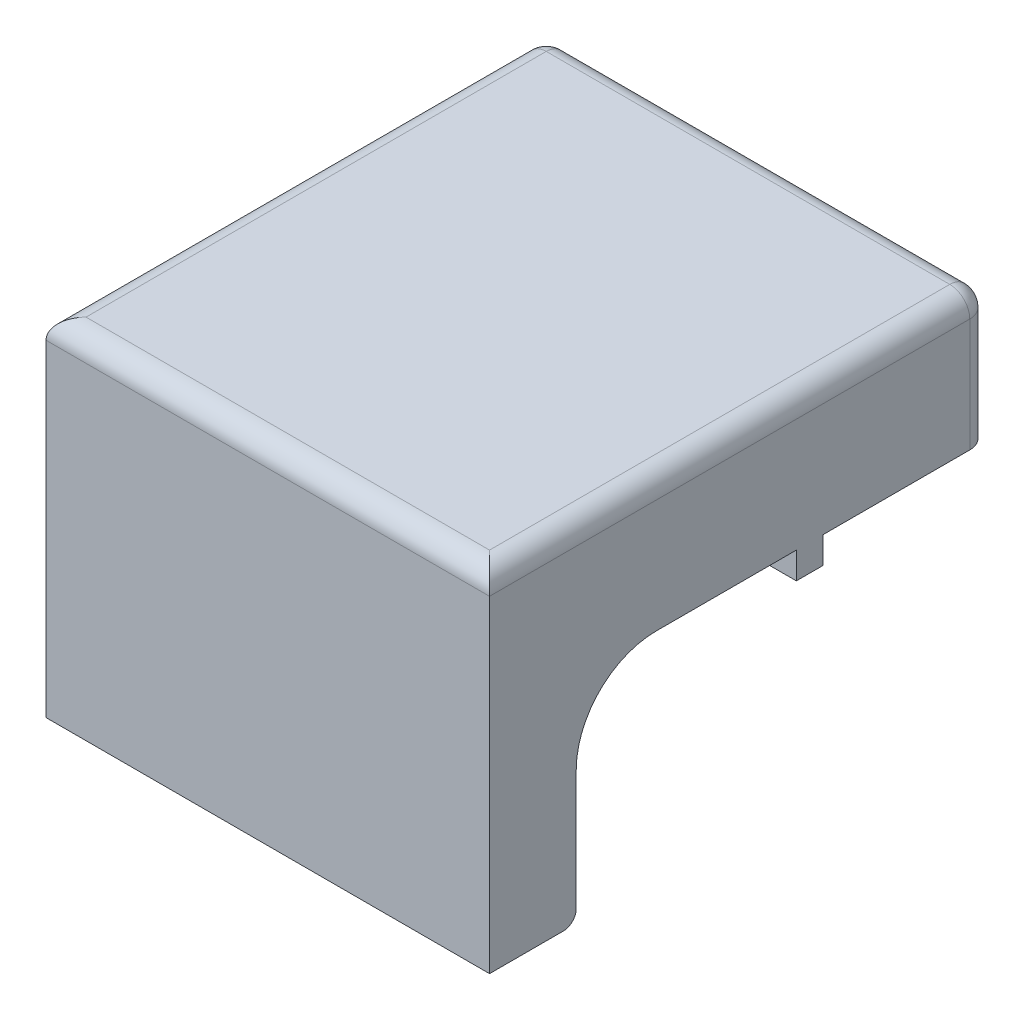
ISO-10303-21;
HEADER;
FILE_DESCRIPTION(('STEP AP214'),'2;1');
FILE_NAME('part.step','',(''),(''),'','','');
FILE_SCHEMA(('AUTOMOTIVE_DESIGN { 1 0 10303 214 1 1 1 1 }'));
ENDSEC;
DATA;
#1=APPLICATION_CONTEXT('core data for automotive mechanical design processes');
#2=APPLICATION_PROTOCOL_DEFINITION('international standard','automotive_design',2000,#1);
#3=PRODUCT_CONTEXT('',#1,'mechanical');
#4=PRODUCT('Part','Part','',(#3));
#5=PRODUCT_RELATED_PRODUCT_CATEGORY('part','',(#4));
#6=PRODUCT_DEFINITION_FORMATION('','',#4);
#7=PRODUCT_DEFINITION_CONTEXT('part definition',#1,'design');
#8=PRODUCT_DEFINITION('design','',#6,#7);
#9=PRODUCT_DEFINITION_SHAPE('','',#8);
#10=(LENGTH_UNIT() NAMED_UNIT(*) SI_UNIT(.MILLI.,.METRE.));
#11=(NAMED_UNIT(*) PLANE_ANGLE_UNIT() SI_UNIT($,.RADIAN.));
#12=(NAMED_UNIT(*) SI_UNIT($,.STERADIAN.) SOLID_ANGLE_UNIT());
#13=UNCERTAINTY_MEASURE_WITH_UNIT(LENGTH_MEASURE(1.E-05),#10,'distance_accuracy_value','');
#14=(GEOMETRIC_REPRESENTATION_CONTEXT(3) GLOBAL_UNCERTAINTY_ASSIGNED_CONTEXT((#13)) GLOBAL_UNIT_ASSIGNED_CONTEXT((#10,
#11,#12)) REPRESENTATION_CONTEXT('',''));
#15=CARTESIAN_POINT('',(0.,0.,0.));
#16=DIRECTION('',(0.,0.,1.));
#17=DIRECTION('',(1.,0.,0.));
#18=AXIS2_PLACEMENT_3D('',#15,#16,#17);
#19=CARTESIAN_POINT('',(0.,-10.,0.));
#20=DIRECTION('',(0.,1.,0.));
#21=DIRECTION('',(0.,0.,1.));
#22=AXIS2_PLACEMENT_3D('',#19,#20,#21);
#23=PLANE('',#22);
#24=DIRECTION('',(-1.,0.,0.));
#25=VECTOR('',#24,1.);
#26=CARTESIAN_POINT('',(23.,-10.,29.));
#27=LINE('',#26,#25);
#28=CARTESIAN_POINT('',(23.,-10.,29.));
#29=VERTEX_POINT('',#28);
#30=CARTESIAN_POINT('',(15.5,-10.,29.));
#31=VERTEX_POINT('',#30);
#32=EDGE_CURVE('E256',#29,#31,#27,.T.);
#33=ORIENTED_EDGE('',*,*,#32,.F.);
#34=DIRECTION('',(0.,0.,1.));
#35=VECTOR('',#34,1.);
#36=CARTESIAN_POINT('',(23.,-10.,0.));
#37=LINE('',#36,#35);
#38=CARTESIAN_POINT('',(23.,-10.,50.));
#39=VERTEX_POINT('',#38);
#40=EDGE_CURVE('E340',#29,#39,#37,.T.);
#41=ORIENTED_EDGE('',*,*,#40,.T.);
#42=DIRECTION('',(-1.,0.,0.));
#43=VECTOR('',#42,1.);
#44=CARTESIAN_POINT('',(0.,-10.,50.));
#45=LINE('',#44,#43);
#46=CARTESIAN_POINT('',(15.5,-10.,50.));
#47=VERTEX_POINT('',#46);
#48=EDGE_CURVE('E422',#39,#47,#45,.T.);
#49=ORIENTED_EDGE('',*,*,#48,.T.);
#50=DIRECTION('',(0.,0.,-1.));
#51=VECTOR('',#50,1.);
#52=CARTESIAN_POINT('',(15.5,-10.,7.5));
#53=LINE('',#52,#51);
#54=EDGE_CURVE('E244',#47,#31,#53,.T.);
#55=ORIENTED_EDGE('',*,*,#54,.T.);
#56=EDGE_LOOP('',(#33,#41,#49,#55));
#57=FACE_BOUND('',#56,.T.);
#58=ADVANCED_FACE('F49',(#57),#23,.F.);
#59=DIRECTION('',(1.,0.,0.));
#60=VECTOR('',#59,1.);
#61=CARTESIAN_POINT('',(-43.5,-10.,0.));
#62=LINE('',#61,#60);
#63=CARTESIAN_POINT('',(0.0437285255018155,-10.,0.));
#64=VERTEX_POINT('',#63);
#65=CARTESIAN_POINT('',(20.,-10.,0.));
#66=VERTEX_POINT('',#65);
#67=EDGE_CURVE('E335',#64,#66,#62,.T.);
#68=ORIENTED_EDGE('',*,*,#67,.T.);
#69=CARTESIAN_POINT('',(20.,-10.,3.));
#70=DIRECTION('',(0.,1.,0.));
#71=DIRECTION('',(0.,0.,1.));
#72=AXIS2_PLACEMENT_3D('',#69,#70,#71);
#73=CIRCLE('',#72,3.);
#74=CARTESIAN_POINT('',(23.,-10.,3.));
#75=VERTEX_POINT('',#74);
#76=EDGE_CURVE('E460',#66,#75,#73,.F.);
#77=ORIENTED_EDGE('',*,*,#76,.T.);
#78=CARTESIAN_POINT('',(23.,-10.,25.));
#79=VERTEX_POINT('',#78);
#80=EDGE_CURVE('E245',#75,#79,#37,.T.);
#81=ORIENTED_EDGE('',*,*,#80,.T.);
#82=DIRECTION('',(1.,0.,0.));
#83=VECTOR('',#82,1.);
#84=CARTESIAN_POINT('',(23.,-10.,25.));
#85=LINE('',#84,#83);
#86=CARTESIAN_POINT('',(15.5,-10.,25.));
#87=VERTEX_POINT('',#86);
#88=EDGE_CURVE('E248',#87,#79,#85,.T.);
#89=ORIENTED_EDGE('',*,*,#88,.F.);
#90=CARTESIAN_POINT('',(15.5,-10.,7.5));
#91=VERTEX_POINT('',#90);
#92=EDGE_CURVE('E231',#87,#91,#53,.T.);
#93=ORIENTED_EDGE('',*,*,#92,.T.);
#94=DIRECTION('',(-1.,0.,0.));
#95=VECTOR('',#94,1.);
#96=CARTESIAN_POINT('',(-36.,-10.,7.5));
#97=LINE('',#96,#95);
#98=CARTESIAN_POINT('',(0.0437285255018155,-10.,7.5));
#99=VERTEX_POINT('',#98);
#100=EDGE_CURVE('E345',#91,#99,#97,.T.);
#101=ORIENTED_EDGE('',*,*,#100,.T.);
#102=DIRECTION('',(0.,0.,-1.));
#103=VECTOR('',#102,1.);
#104=CARTESIAN_POINT('',(0.0437285255018155,-10.,10.));
#105=LINE('',#104,#103);
#106=EDGE_CURVE('E407',#99,#64,#105,.T.);
#107=ORIENTED_EDGE('',*,*,#106,.T.);
#108=EDGE_LOOP('',(#68,#77,#81,#89,#93,#101,#107));
#109=FACE_BOUND('',#108,.T.);
#110=ADVANCED_FACE('F250',(#109),#23,.F.);
#111=DIRECTION('',(0.,0.,-1.));
#112=VECTOR('',#111,1.);
#113=CARTESIAN_POINT('',(-43.5,-10.,0.));
#114=LINE('',#113,#112);
#115=CARTESIAN_POINT('',(-43.5,-10.,25.));
#116=VERTEX_POINT('',#115);
#117=CARTESIAN_POINT('',(-43.5,-10.,3.00000000000001));
#118=VERTEX_POINT('',#117);
#119=EDGE_CURVE('E336',#116,#118,#114,.T.);
#120=ORIENTED_EDGE('',*,*,#119,.T.);
#121=CARTESIAN_POINT('',(-40.5,-10.,3.));
#122=DIRECTION('',(0.,1.,0.));
#123=DIRECTION('',(0.,0.,1.));
#124=AXIS2_PLACEMENT_3D('',#121,#122,#123);
#125=CIRCLE('',#124,3.);
#126=CARTESIAN_POINT('',(-40.5,-10.,0.));
#127=VERTEX_POINT('',#126);
#128=EDGE_CURVE('E469',#118,#127,#125,.F.);
#129=ORIENTED_EDGE('',*,*,#128,.T.);
#130=CARTESIAN_POINT('',(-32.0437285255018,-10.,0.));
#131=VERTEX_POINT('',#130);
#132=EDGE_CURVE('E337',#127,#131,#62,.T.);
#133=ORIENTED_EDGE('',*,*,#132,.T.);
#134=DIRECTION('',(0.,0.,-1.));
#135=VECTOR('',#134,1.);
#136=CARTESIAN_POINT('',(-32.0437285255018,-10.,10.));
#137=LINE('',#136,#135);
#138=CARTESIAN_POINT('',(-32.0437285255018,-10.,7.5));
#139=VERTEX_POINT('',#138);
#140=EDGE_CURVE('E403',#131,#139,#137,.F.);
#141=ORIENTED_EDGE('',*,*,#140,.T.);
#142=CARTESIAN_POINT('',(-36.,-10.,7.5));
#143=VERTEX_POINT('',#142);
#144=EDGE_CURVE('E344',#139,#143,#97,.T.);
#145=ORIENTED_EDGE('',*,*,#144,.T.);
#146=DIRECTION('',(0.,0.,1.));
#147=VECTOR('',#146,1.);
#148=CARTESIAN_POINT('',(-36.,-10.,62.));
#149=LINE('',#148,#147);
#150=CARTESIAN_POINT('',(-36.,-10.,25.));
#151=VERTEX_POINT('',#150);
#152=EDGE_CURVE('E349',#143,#151,#149,.T.);
#153=ORIENTED_EDGE('',*,*,#152,.T.);
#154=DIRECTION('',(1.,0.,0.));
#155=VECTOR('',#154,1.);
#156=CARTESIAN_POINT('',(-43.5,-10.,25.));
#157=LINE('',#156,#155);
#158=EDGE_CURVE('E276',#116,#151,#157,.T.);
#159=ORIENTED_EDGE('',*,*,#158,.F.);
#160=EDGE_LOOP('',(#120,#129,#133,#141,#145,#153,#159));
#161=FACE_BOUND('',#160,.T.);
#162=ADVANCED_FACE('F593',(#161),#23,.F.);
#163=DIRECTION('',(-1.,0.,0.));
#164=VECTOR('',#163,1.);
#165=CARTESIAN_POINT('',(-43.5,-10.,29.));
#166=LINE('',#165,#164);
#167=CARTESIAN_POINT('',(-36.,-10.,29.));
#168=VERTEX_POINT('',#167);
#169=CARTESIAN_POINT('',(-43.5,-10.,29.));
#170=VERTEX_POINT('',#169);
#171=EDGE_CURVE('E293',#168,#170,#166,.T.);
#172=ORIENTED_EDGE('',*,*,#171,.F.);
#173=CARTESIAN_POINT('',(-36.,-10.,50.));
#174=VERTEX_POINT('',#173);
#175=EDGE_CURVE('E348',#168,#174,#149,.T.);
#176=ORIENTED_EDGE('',*,*,#175,.T.);
#177=DIRECTION('',(-1.,0.,0.));
#178=VECTOR('',#177,1.);
#179=CARTESIAN_POINT('',(0.,-10.,50.));
#180=LINE('',#179,#178);
#181=CARTESIAN_POINT('',(-43.5,-10.,50.));
#182=VERTEX_POINT('',#181);
#183=EDGE_CURVE('E411',#174,#182,#180,.T.);
#184=ORIENTED_EDGE('',*,*,#183,.T.);
#185=EDGE_CURVE('E332',#182,#170,#114,.T.);
#186=ORIENTED_EDGE('',*,*,#185,.T.);
#187=EDGE_LOOP('',(#172,#176,#184,#186));
#188=FACE_BOUND('',#187,.T.);
#189=ADVANCED_FACE('F614',(#188),#23,.F.);
#190=CARTESIAN_POINT('',(0.,0.,0.));
#191=DIRECTION('',(0.,1.,0.));
#192=DIRECTION('',(0.,0.,1.));
#193=AXIS2_PLACEMENT_3D('',#190,#191,#192);
#194=PLANE('',#193);
#195=DIRECTION('',(0.,0.,-1.));
#196=VECTOR('',#195,1.);
#197=CARTESIAN_POINT('',(15.5,0.,7.5));
#198=LINE('',#197,#196);
#199=CARTESIAN_POINT('',(15.5,0.,62.));
#200=VERTEX_POINT('',#199);
#201=CARTESIAN_POINT('',(15.5,0.,7.5));
#202=VERTEX_POINT('',#201);
#203=EDGE_CURVE('E331',#200,#202,#198,.T.);
#204=ORIENTED_EDGE('',*,*,#203,.F.);
#205=DIRECTION('',(-1.,0.,0.));
#206=VECTOR('',#205,1.);
#207=CARTESIAN_POINT('',(0.,0.,62.));
#208=LINE('',#207,#206);
#209=CARTESIAN_POINT('',(-36.,0.,62.));
#210=VERTEX_POINT('',#209);
#211=EDGE_CURVE('E389',#200,#210,#208,.T.);
#212=ORIENTED_EDGE('',*,*,#211,.T.);
#213=DIRECTION('',(0.,0.,1.));
#214=VECTOR('',#213,1.);
#215=CARTESIAN_POINT('',(-36.,0.,62.));
#216=LINE('',#215,#214);
#217=CARTESIAN_POINT('',(-36.,0.,7.5));
#218=VERTEX_POINT('',#217);
#219=EDGE_CURVE('E358',#218,#210,#216,.T.);
#220=ORIENTED_EDGE('',*,*,#219,.F.);
#221=DIRECTION('',(-1.,0.,0.));
#222=VECTOR('',#221,1.);
#223=CARTESIAN_POINT('',(-36.,0.,7.5));
#224=LINE('',#223,#222);
#225=EDGE_CURVE('E355',#202,#218,#224,.T.);
#226=ORIENTED_EDGE('',*,*,#225,.F.);
#227=EDGE_LOOP('',(#204,#212,#220,#226));
#228=FACE_BOUND('',#227,.T.);
#229=ADVANCED_FACE('F631',(#228),#194,.F.);
#230=CARTESIAN_POINT('',(-43.5,10.,62.));
#231=DIRECTION('',(0.,0.,-1.));
#232=DIRECTION('',(-1.,0.,0.));
#233=AXIS2_PLACEMENT_3D('',#230,#231,#232);
#234=PLANE('',#233);
#235=DIRECTION('',(0.,-1.,0.));
#236=VECTOR('',#235,1.);
#237=CARTESIAN_POINT('',(23.,10.,62.));
#238=LINE('',#237,#236);
#239=CARTESIAN_POINT('',(23.,-22.,62.));
#240=VERTEX_POINT('',#239);
#241=CARTESIAN_POINT('',(23.,-40.05,62.));
#242=VERTEX_POINT('',#241);
#243=EDGE_CURVE('E393',#240,#242,#238,.T.);
#244=ORIENTED_EDGE('',*,*,#243,.T.);
#245=DIRECTION('',(1.,0.,0.));
#246=VECTOR('',#245,1.);
#247=CARTESIAN_POINT('',(-43.5,-40.05,62.));
#248=LINE('',#247,#246);
#249=CARTESIAN_POINT('',(-43.5,-40.05,62.));
#250=VERTEX_POINT('',#249);
#251=EDGE_CURVE('E448',#242,#250,#248,.F.);
#252=ORIENTED_EDGE('',*,*,#251,.T.);
#253=DIRECTION('',(0.,-1.,0.));
#254=VECTOR('',#253,1.);
#255=CARTESIAN_POINT('',(-43.5,10.,62.));
#256=LINE('',#255,#254);
#257=CARTESIAN_POINT('',(-43.5,-22.,62.));
#258=VERTEX_POINT('',#257);
#259=EDGE_CURVE('E385',#258,#250,#256,.T.);
#260=ORIENTED_EDGE('',*,*,#259,.F.);
#261=DIRECTION('',(-1.,0.,0.));
#262=VECTOR('',#261,1.);
#263=CARTESIAN_POINT('',(-43.5,-22.,62.));
#264=LINE('',#263,#262);
#265=CARTESIAN_POINT('',(-36.,-22.,62.));
#266=VERTEX_POINT('',#265);
#267=EDGE_CURVE('E418',#258,#266,#264,.F.);
#268=ORIENTED_EDGE('',*,*,#267,.T.);
#269=DIRECTION('',(0.,1.,0.));
#270=VECTOR('',#269,1.);
#271=CARTESIAN_POINT('',(-36.,-10.,62.));
#272=LINE('',#271,#270);
#273=EDGE_CURVE('E352',#266,#210,#272,.T.);
#274=ORIENTED_EDGE('',*,*,#273,.T.);
#275=ORIENTED_EDGE('',*,*,#211,.F.);
#276=DIRECTION('',(0.,1.,0.));
#277=VECTOR('',#276,1.);
#278=CARTESIAN_POINT('',(15.5,-10.,62.));
#279=LINE('',#278,#277);
#280=CARTESIAN_POINT('',(15.5,-22.,62.));
#281=VERTEX_POINT('',#280);
#282=EDGE_CURVE('E370',#281,#200,#279,.T.);
#283=ORIENTED_EDGE('',*,*,#282,.F.);
#284=DIRECTION('',(-1.,0.,0.));
#285=VECTOR('',#284,1.);
#286=CARTESIAN_POINT('',(-43.5,-22.,62.));
#287=LINE('',#286,#285);
#288=EDGE_CURVE('E415',#281,#240,#287,.F.);
#289=ORIENTED_EDGE('',*,*,#288,.T.);
#290=EDGE_LOOP('',(#244,#252,#260,#268,#274,#275,#283,#289));
#291=FACE_BOUND('',#290,.T.);
#292=ADVANCED_FACE('F577',(#291),#234,.T.);
#293=CARTESIAN_POINT('',(0.,10.,0.));
#294=DIRECTION('',(0.,0.,1.));
#295=DIRECTION('',(1.,0.,0.));
#296=AXIS2_PLACEMENT_3D('',#293,#294,#295);
#297=PLANE('',#296);
#298=DIRECTION('',(0.,-1.,0.));
#299=VECTOR('',#298,1.);
#300=CARTESIAN_POINT('',(-40.5,10.,0.));
#301=LINE('',#300,#299);
#302=CARTESIAN_POINT('',(-40.5,7.,0.));
#303=VERTEX_POINT('',#302);
#304=EDGE_CURVE('E454',#127,#303,#301,.F.);
#305=ORIENTED_EDGE('',*,*,#304,.T.);
#306=DIRECTION('',(-1.,0.,0.));
#307=VECTOR('',#306,1.);
#308=CARTESIAN_POINT('',(20.,7.,0.));
#309=LINE('',#308,#307);
#310=CARTESIAN_POINT('',(20.,7.,0.));
#311=VERTEX_POINT('',#310);
#312=EDGE_CURVE('E74',#303,#311,#309,.F.);
#313=ORIENTED_EDGE('',*,*,#312,.T.);
#314=DIRECTION('',(0.,-1.,0.));
#315=VECTOR('',#314,1.);
#316=CARTESIAN_POINT('',(20.,10.,0.));
#317=LINE('',#316,#315);
#318=EDGE_CURVE('E457',#311,#66,#317,.T.);
#319=ORIENTED_EDGE('',*,*,#318,.T.);
#320=ORIENTED_EDGE('',*,*,#67,.F.);
#321=CARTESIAN_POINT('',(-16.,-22.,0.));
#322=DIRECTION('',(0.,0.,-1.));
#323=DIRECTION('',(-1.,0.,0.));
#324=AXIS2_PLACEMENT_3D('',#321,#322,#323);
#325=CIRCLE('',#324,20.035);
#326=EDGE_CURVE('E324',#131,#64,#325,.T.);
#327=ORIENTED_EDGE('',*,*,#326,.F.);
#328=ORIENTED_EDGE('',*,*,#132,.F.);
#329=EDGE_LOOP('',(#305,#313,#319,#320,#327,#328));
#330=FACE_BOUND('',#329,.T.);
#331=ADVANCED_FACE('F666',(#330),#297,.F.);
#332=CARTESIAN_POINT('',(-43.5,10.,0.));
#333=DIRECTION('',(1.,0.,0.));
#334=DIRECTION('',(0.,0.,-1.));
#335=AXIS2_PLACEMENT_3D('',#332,#333,#334);
#336=PLANE('',#335);
#337=DIRECTION('',(0.,-1.,0.));
#338=VECTOR('',#337,1.);
#339=CARTESIAN_POINT('',(-43.5,10.,75.));
#340=LINE('',#339,#338);
#341=CARTESIAN_POINT('',(-43.5,7.,75.));
#342=VERTEX_POINT('',#341);
#343=CARTESIAN_POINT('',(-43.5,-42.,75.));
#344=VERTEX_POINT('',#343);
#345=EDGE_CURVE('E386',#342,#344,#340,.T.);
#346=ORIENTED_EDGE('',*,*,#345,.F.);
#347=DIRECTION('',(0.,0.,1.));
#348=VECTOR('',#347,1.);
#349=CARTESIAN_POINT('',(-43.5,7.,3.00000000000001));
#350=LINE('',#349,#348);
#351=CARTESIAN_POINT('',(-43.5,7.,3.00000000000001));
#352=VERTEX_POINT('',#351);
#353=EDGE_CURVE('E489',#342,#352,#350,.F.);
#354=ORIENTED_EDGE('',*,*,#353,.T.);
#355=DIRECTION('',(0.,-1.,0.));
#356=VECTOR('',#355,1.);
#357=CARTESIAN_POINT('',(-43.5,10.,3.00000000000001));
#358=LINE('',#357,#356);
#359=EDGE_CURVE('E466',#352,#118,#358,.T.);
#360=ORIENTED_EDGE('',*,*,#359,.T.);
#361=ORIENTED_EDGE('',*,*,#119,.F.);
#362=DIRECTION('',(0.,1.,0.));
#363=VECTOR('',#362,1.);
#364=CARTESIAN_POINT('',(-43.5,-14.,25.));
#365=LINE('',#364,#363);
#366=CARTESIAN_POINT('',(-43.5,-14.,25.));
#367=VERTEX_POINT('',#366);
#368=EDGE_CURVE('E320',#367,#116,#365,.T.);
#369=ORIENTED_EDGE('',*,*,#368,.F.);
#370=DIRECTION('',(0.,0.,-1.));
#371=VECTOR('',#370,1.);
#372=CARTESIAN_POINT('',(-43.5,-14.,25.));
#373=LINE('',#372,#371);
#374=CARTESIAN_POINT('',(-43.5,-14.,29.));
#375=VERTEX_POINT('',#374);
#376=EDGE_CURVE('E288',#375,#367,#373,.T.);
#377=ORIENTED_EDGE('',*,*,#376,.F.);
#378=DIRECTION('',(0.,1.,0.));
#379=VECTOR('',#378,1.);
#380=CARTESIAN_POINT('',(-43.5,-14.,29.));
#381=LINE('',#380,#379);
#382=EDGE_CURVE('E302',#375,#170,#381,.T.);
#383=ORIENTED_EDGE('',*,*,#382,.T.);
#384=ORIENTED_EDGE('',*,*,#185,.F.);
#385=CARTESIAN_POINT('',(-43.5,-22.,50.));
#386=DIRECTION('',(1.,0.,0.));
#387=DIRECTION('',(0.,0.,-1.));
#388=AXIS2_PLACEMENT_3D('',#385,#386,#387);
#389=CIRCLE('',#388,12.);
#390=EDGE_CURVE('E426',#182,#258,#389,.T.);
#391=ORIENTED_EDGE('',*,*,#390,.T.);
#392=ORIENTED_EDGE('',*,*,#259,.T.);
#393=CARTESIAN_POINT('',(-43.5,-40.05,63.95));
#394=DIRECTION('',(1.,0.,0.));
#395=DIRECTION('',(0.,0.,-1.));
#396=AXIS2_PLACEMENT_3D('',#393,#394,#395);
#397=CIRCLE('',#396,1.95);
#398=CARTESIAN_POINT('',(-43.5,-42.,63.95));
#399=VERTEX_POINT('',#398);
#400=EDGE_CURVE('E451',#250,#399,#397,.F.);
#401=ORIENTED_EDGE('',*,*,#400,.T.);
#402=DIRECTION('',(0.,0.,-1.));
#403=VECTOR('',#402,1.);
#404=CARTESIAN_POINT('',(-43.5,-42.,68.));
#405=LINE('',#404,#403);
#406=EDGE_CURVE('E373',#344,#399,#405,.T.);
#407=ORIENTED_EDGE('',*,*,#406,.F.);
#408=EDGE_LOOP('',(#346,#354,#360,#361,#369,#377,#383,#384,#391,#392,#401,#407));
#409=FACE_BOUND('',#408,.T.);
#410=ADVANCED_FACE('F597',(#409),#336,.F.);
#411=CARTESIAN_POINT('',(23.,10.,68.));
#412=DIRECTION('',(-1.,0.,0.));
#413=DIRECTION('',(0.,0.,1.));
#414=AXIS2_PLACEMENT_3D('',#411,#412,#413);
#415=PLANE('',#414);
#416=DIRECTION('',(0.,-1.,0.));
#417=VECTOR('',#416,1.);
#418=CARTESIAN_POINT('',(23.,10.,3.));
#419=LINE('',#418,#417);
#420=CARTESIAN_POINT('',(23.,7.,3.));
#421=VERTEX_POINT('',#420);
#422=EDGE_CURVE('E463',#75,#421,#419,.F.);
#423=ORIENTED_EDGE('',*,*,#422,.T.);
#424=DIRECTION('',(0.,0.,-1.));
#425=VECTOR('',#424,1.);
#426=CARTESIAN_POINT('',(23.,7.,75.));
#427=LINE('',#426,#425);
#428=CARTESIAN_POINT('',(23.,7.,75.));
#429=VERTEX_POINT('',#428);
#430=EDGE_CURVE('E11',#421,#429,#427,.F.);
#431=ORIENTED_EDGE('',*,*,#430,.T.);
#432=DIRECTION('',(0.,-1.,0.));
#433=VECTOR('',#432,1.);
#434=CARTESIAN_POINT('',(23.,10.,75.));
#435=LINE('',#434,#433);
#436=CARTESIAN_POINT('',(23.,-42.,75.));
#437=VERTEX_POINT('',#436);
#438=EDGE_CURVE('E390',#429,#437,#435,.T.);
#439=ORIENTED_EDGE('',*,*,#438,.T.);
#440=DIRECTION('',(0.,0.,1.));
#441=VECTOR('',#440,1.);
#442=CARTESIAN_POINT('',(23.,-42.,62.));
#443=LINE('',#442,#441);
#444=CARTESIAN_POINT('',(23.,-42.,63.95));
#445=VERTEX_POINT('',#444);
#446=EDGE_CURVE('E377',#445,#437,#443,.T.);
#447=ORIENTED_EDGE('',*,*,#446,.F.);
#448=CARTESIAN_POINT('',(23.,-40.05,63.95));
#449=DIRECTION('',(-1.,0.,0.));
#450=DIRECTION('',(0.,0.,1.));
#451=AXIS2_PLACEMENT_3D('',#448,#449,#450);
#452=CIRCLE('',#451,1.95);
#453=EDGE_CURVE('E445',#445,#242,#452,.F.);
#454=ORIENTED_EDGE('',*,*,#453,.T.);
#455=ORIENTED_EDGE('',*,*,#243,.F.);
#456=CARTESIAN_POINT('',(23.,-22.,50.));
#457=DIRECTION('',(-1.,0.,0.));
#458=DIRECTION('',(0.,0.,1.));
#459=AXIS2_PLACEMENT_3D('',#456,#457,#458);
#460=CIRCLE('',#459,12.);
#461=EDGE_CURVE('E437',#240,#39,#460,.T.);
#462=ORIENTED_EDGE('',*,*,#461,.T.);
#463=ORIENTED_EDGE('',*,*,#40,.F.);
#464=DIRECTION('',(0.,1.,0.));
#465=VECTOR('',#464,1.);
#466=CARTESIAN_POINT('',(23.,-14.,29.));
#467=LINE('',#466,#465);
#468=CARTESIAN_POINT('',(23.,-14.,29.));
#469=VERTEX_POINT('',#468);
#470=EDGE_CURVE('E269',#469,#29,#467,.T.);
#471=ORIENTED_EDGE('',*,*,#470,.F.);
#472=DIRECTION('',(0.,0.,1.));
#473=VECTOR('',#472,1.);
#474=CARTESIAN_POINT('',(23.,-14.,25.));
#475=LINE('',#474,#473);
#476=CARTESIAN_POINT('',(23.,-14.,25.));
#477=VERTEX_POINT('',#476);
#478=EDGE_CURVE('E257',#477,#469,#475,.T.);
#479=ORIENTED_EDGE('',*,*,#478,.F.);
#480=DIRECTION('',(0.,1.,0.));
#481=VECTOR('',#480,1.);
#482=CARTESIAN_POINT('',(23.,-14.,25.));
#483=LINE('',#482,#481);
#484=EDGE_CURVE('E262',#477,#79,#483,.T.);
#485=ORIENTED_EDGE('',*,*,#484,.T.);
#486=ORIENTED_EDGE('',*,*,#80,.F.);
#487=EDGE_LOOP('',(#423,#431,#439,#447,#454,#455,#462,#463,#471,#479,#485,#486));
#488=FACE_BOUND('',#487,.T.);
#489=ADVANCED_FACE('F574',(#488),#415,.F.);
#490=CARTESIAN_POINT('',(0.,10.,0.));
#491=DIRECTION('',(0.,1.,0.));
#492=DIRECTION('',(0.,0.,1.));
#493=AXIS2_PLACEMENT_3D('',#490,#491,#492);
#494=PLANE('',#493);
#495=DIRECTION('',(0.,0.,1.));
#496=VECTOR('',#495,1.);
#497=CARTESIAN_POINT('',(-40.5,10.,75.));
#498=LINE('',#497,#496);
#499=CARTESIAN_POINT('',(-40.5,10.,3.));
#500=VERTEX_POINT('',#499);
#501=CARTESIAN_POINT('',(-40.5,10.,72.));
#502=VERTEX_POINT('',#501);
#503=EDGE_CURVE('E482',#500,#502,#498,.T.);
#504=ORIENTED_EDGE('',*,*,#503,.T.);
#505=DIRECTION('',(-1.,0.,0.));
#506=VECTOR('',#505,1.);
#507=CARTESIAN_POINT('',(0.,10.,72.));
#508=LINE('',#507,#506);
#509=CARTESIAN_POINT('',(20.,10.,72.));
#510=VERTEX_POINT('',#509);
#511=EDGE_CURVE('E485',#502,#510,#508,.F.);
#512=ORIENTED_EDGE('',*,*,#511,.T.);
#513=DIRECTION('',(0.,0.,-1.));
#514=VECTOR('',#513,1.);
#515=CARTESIAN_POINT('',(20.,10.,3.));
#516=LINE('',#515,#514);
#517=CARTESIAN_POINT('',(20.,10.,3.));
#518=VERTEX_POINT('',#517);
#519=EDGE_CURVE('E476',#510,#518,#516,.T.);
#520=ORIENTED_EDGE('',*,*,#519,.T.);
#521=DIRECTION('',(-1.,0.,0.));
#522=VECTOR('',#521,1.);
#523=CARTESIAN_POINT('',(-40.5,10.,3.));
#524=LINE('',#523,#522);
#525=EDGE_CURVE('E479',#518,#500,#524,.T.);
#526=ORIENTED_EDGE('',*,*,#525,.T.);
#527=EDGE_LOOP('',(#504,#512,#520,#526));
#528=FACE_BOUND('',#527,.T.);
#529=ADVANCED_FACE('F670',(#528),#494,.T.);
#530=CARTESIAN_POINT('',(-43.5,10.,75.));
#531=DIRECTION('',(0.,0.,1.));
#532=DIRECTION('',(1.,0.,0.));
#533=AXIS2_PLACEMENT_3D('',#530,#531,#532);
#534=PLANE('',#533);
#535=ORIENTED_EDGE('',*,*,#438,.F.);
#536=DIRECTION('',(-1.,0.,0.));
#537=VECTOR('',#536,1.);
#538=CARTESIAN_POINT('',(-43.5,7.,75.));
#539=LINE('',#538,#537);
#540=EDGE_CURVE('E472',#429,#342,#539,.T.);
#541=ORIENTED_EDGE('',*,*,#540,.T.);
#542=ORIENTED_EDGE('',*,*,#345,.T.);
#543=DIRECTION('',(-1.,0.,0.));
#544=VECTOR('',#543,1.);
#545=CARTESIAN_POINT('',(-43.5,-42.,75.));
#546=LINE('',#545,#544);
#547=EDGE_CURVE('E381',#437,#344,#546,.T.);
#548=ORIENTED_EDGE('',*,*,#547,.F.);
#549=EDGE_LOOP('',(#535,#541,#542,#548));
#550=FACE_BOUND('',#549,.T.);
#551=ADVANCED_FACE('F558',(#550),#534,.T.);
#552=CARTESIAN_POINT('',(0.,-42.,0.));
#553=DIRECTION('',(0.,1.,0.));
#554=DIRECTION('',(0.,0.,1.));
#555=AXIS2_PLACEMENT_3D('',#552,#553,#554);
#556=PLANE('',#555);
#557=CARTESIAN_POINT('',(-28.5,-42.,68.));
#558=DIRECTION('',(0.,-1.,0.));
#559=DIRECTION('',(0.,0.,-1.));
#560=AXIS2_PLACEMENT_3D('',#557,#558,#559);
#561=CIRCLE('',#560,3.);
#562=CARTESIAN_POINT('',(-28.5,-42.,65.));
#563=VERTEX_POINT('',#562);
#564=EDGE_CURVE('E538',#563,#563,#561,.T.);
#565=ORIENTED_EDGE('',*,*,#564,.F.);
#566=EDGE_LOOP('',(#565));
#567=FACE_BOUND('',#566,.T.);
#568=CARTESIAN_POINT('',(5.50000000000003,-42.,68.));
#569=DIRECTION('',(0.,-1.,0.));
#570=DIRECTION('',(0.,0.,-1.));
#571=AXIS2_PLACEMENT_3D('',#568,#569,#570);
#572=CIRCLE('',#571,3.);
#573=CARTESIAN_POINT('',(5.50000000000003,-42.,65.));
#574=VERTEX_POINT('',#573);
#575=EDGE_CURVE('E534',#574,#574,#572,.T.);
#576=ORIENTED_EDGE('',*,*,#575,.F.);
#577=EDGE_LOOP('',(#576));
#578=FACE_BOUND('',#577,.T.);
#579=ORIENTED_EDGE('',*,*,#406,.T.);
#580=DIRECTION('',(1.,0.,0.));
#581=VECTOR('',#580,1.);
#582=CARTESIAN_POINT('',(23.,-42.,63.95));
#583=LINE('',#582,#581);
#584=EDGE_CURVE('E441',#399,#445,#583,.T.);
#585=ORIENTED_EDGE('',*,*,#584,.T.);
#586=ORIENTED_EDGE('',*,*,#446,.T.);
#587=ORIENTED_EDGE('',*,*,#547,.T.);
#588=EDGE_LOOP('',(#579,#585,#586,#587));
#589=FACE_BOUND('',#588,.T.);
#590=ADVANCED_FACE('F555',(#567,#578,#589),#556,.F.);
#591=CARTESIAN_POINT('',(15.5,-10.,7.5));
#592=DIRECTION('',(1.,0.,0.));
#593=DIRECTION('',(0.,0.,-1.));
#594=AXIS2_PLACEMENT_3D('',#591,#592,#593);
#595=PLANE('',#594);
#596=ORIENTED_EDGE('',*,*,#203,.T.);
#597=DIRECTION('',(0.,1.,0.));
#598=VECTOR('',#597,1.);
#599=CARTESIAN_POINT('',(15.5,-10.,7.5));
#600=LINE('',#599,#598);
#601=EDGE_CURVE('E239',#91,#202,#600,.T.);
#602=ORIENTED_EDGE('',*,*,#601,.F.);
#603=ORIENTED_EDGE('',*,*,#92,.F.);
#604=DIRECTION('',(0.,1.,0.));
#605=VECTOR('',#604,1.);
#606=CARTESIAN_POINT('',(15.5,-14.,25.));
#607=LINE('',#606,#605);
#608=CARTESIAN_POINT('',(15.5,-14.,25.));
#609=VERTEX_POINT('',#608);
#610=EDGE_CURVE('E236',#609,#87,#607,.T.);
#611=ORIENTED_EDGE('',*,*,#610,.F.);
#612=DIRECTION('',(0.,0.,-1.));
#613=VECTOR('',#612,1.);
#614=CARTESIAN_POINT('',(15.5,-14.,25.));
#615=LINE('',#614,#613);
#616=CARTESIAN_POINT('',(15.5,-14.,29.));
#617=VERTEX_POINT('',#616);
#618=EDGE_CURVE('E279',#617,#609,#615,.T.);
#619=ORIENTED_EDGE('',*,*,#618,.F.);
#620=DIRECTION('',(0.,1.,0.));
#621=VECTOR('',#620,1.);
#622=CARTESIAN_POINT('',(15.5,-14.,29.));
#623=LINE('',#622,#621);
#624=EDGE_CURVE('E263',#617,#31,#623,.T.);
#625=ORIENTED_EDGE('',*,*,#624,.T.);
#626=ORIENTED_EDGE('',*,*,#54,.F.);
#627=CARTESIAN_POINT('',(15.5,-22.,50.));
#628=DIRECTION('',(1.,0.,0.));
#629=DIRECTION('',(0.,0.,-1.));
#630=AXIS2_PLACEMENT_3D('',#627,#628,#629);
#631=CIRCLE('',#630,12.);
#632=EDGE_CURVE('E433',#47,#281,#631,.T.);
#633=ORIENTED_EDGE('',*,*,#632,.T.);
#634=ORIENTED_EDGE('',*,*,#282,.T.);
#635=EDGE_LOOP('',(#596,#602,#603,#611,#619,#625,#626,#633,#634));
#636=FACE_BOUND('',#635,.T.);
#637=ADVANCED_FACE('F233',(#636),#595,.F.);
#638=CARTESIAN_POINT('',(-36.,-10.,7.5));
#639=DIRECTION('',(0.,0.,-1.));
#640=DIRECTION('',(-1.,0.,0.));
#641=AXIS2_PLACEMENT_3D('',#638,#639,#640);
#642=PLANE('',#641);
#643=ORIENTED_EDGE('',*,*,#144,.F.);
#644=CARTESIAN_POINT('',(-16.,-22.,7.5));
#645=DIRECTION('',(0.,0.,-1.));
#646=DIRECTION('',(-1.,0.,0.));
#647=AXIS2_PLACEMENT_3D('',#644,#645,#646);
#648=CIRCLE('',#647,20.035);
#649=EDGE_CURVE('E327',#139,#99,#648,.T.);
#650=ORIENTED_EDGE('',*,*,#649,.T.);
#651=ORIENTED_EDGE('',*,*,#100,.F.);
#652=ORIENTED_EDGE('',*,*,#601,.T.);
#653=ORIENTED_EDGE('',*,*,#225,.T.);
#654=DIRECTION('',(0.,1.,0.));
#655=VECTOR('',#654,1.);
#656=CARTESIAN_POINT('',(-36.,-10.,7.5));
#657=LINE('',#656,#655);
#658=EDGE_CURVE('E364',#143,#218,#657,.T.);
#659=ORIENTED_EDGE('',*,*,#658,.F.);
#660=EDGE_LOOP('',(#643,#650,#651,#652,#653,#659));
#661=FACE_BOUND('',#660,.T.);
#662=ADVANCED_FACE('F626',(#661),#642,.F.);
#663=CARTESIAN_POINT('',(-36.,-10.,62.));
#664=DIRECTION('',(-1.,0.,0.));
#665=DIRECTION('',(0.,0.,1.));
#666=AXIS2_PLACEMENT_3D('',#663,#664,#665);
#667=PLANE('',#666);
#668=ORIENTED_EDGE('',*,*,#219,.T.);
#669=ORIENTED_EDGE('',*,*,#273,.F.);
#670=CARTESIAN_POINT('',(-36.,-22.,50.));
#671=DIRECTION('',(-1.,0.,0.));
#672=DIRECTION('',(0.,0.,1.));
#673=AXIS2_PLACEMENT_3D('',#670,#671,#672);
#674=CIRCLE('',#673,12.);
#675=EDGE_CURVE('E429',#266,#174,#674,.T.);
#676=ORIENTED_EDGE('',*,*,#675,.T.);
#677=ORIENTED_EDGE('',*,*,#175,.F.);
#678=DIRECTION('',(0.,1.,0.));
#679=VECTOR('',#678,1.);
#680=CARTESIAN_POINT('',(-36.,-14.,29.));
#681=LINE('',#680,#679);
#682=CARTESIAN_POINT('',(-36.,-14.,29.));
#683=VERTEX_POINT('',#682);
#684=EDGE_CURVE('E312',#683,#168,#681,.T.);
#685=ORIENTED_EDGE('',*,*,#684,.F.);
#686=DIRECTION('',(0.,0.,1.));
#687=VECTOR('',#686,1.);
#688=CARTESIAN_POINT('',(-36.,-14.,25.));
#689=LINE('',#688,#687);
#690=CARTESIAN_POINT('',(-36.,-14.,25.));
#691=VERTEX_POINT('',#690);
#692=EDGE_CURVE('E296',#691,#683,#689,.T.);
#693=ORIENTED_EDGE('',*,*,#692,.F.);
#694=DIRECTION('',(0.,1.,0.));
#695=VECTOR('',#694,1.);
#696=CARTESIAN_POINT('',(-36.,-14.,25.));
#697=LINE('',#696,#695);
#698=EDGE_CURVE('E316',#691,#151,#697,.T.);
#699=ORIENTED_EDGE('',*,*,#698,.T.);
#700=ORIENTED_EDGE('',*,*,#152,.F.);
#701=ORIENTED_EDGE('',*,*,#658,.T.);
#702=EDGE_LOOP('',(#668,#669,#676,#677,#685,#693,#699,#700,#701));
#703=FACE_BOUND('',#702,.T.);
#704=ADVANCED_FACE('F616',(#703),#667,.F.);
#705=CARTESIAN_POINT('',(-16.,-22.,10.));
#706=DIRECTION('',(0.,0.,-1.));
#707=DIRECTION('',(-1.,0.,0.));
#708=AXIS2_PLACEMENT_3D('',#705,#706,#707);
#709=CYLINDRICAL_SURFACE('',#708,20.035);
#710=ORIENTED_EDGE('',*,*,#649,.F.);
#711=ORIENTED_EDGE('',*,*,#140,.F.);
#712=ORIENTED_EDGE('',*,*,#326,.T.);
#713=ORIENTED_EDGE('',*,*,#106,.F.);
#714=EDGE_LOOP('',(#710,#711,#712,#713));
#715=FACE_BOUND('',#714,.T.);
#716=ADVANCED_FACE('F636',(#715),#709,.F.);
#717=CARTESIAN_POINT('',(0.,-22.,50.));
#718=DIRECTION('',(-1.,0.,0.));
#719=DIRECTION('',(0.,0.,1.));
#720=AXIS2_PLACEMENT_3D('',#717,#718,#719);
#721=CYLINDRICAL_SURFACE('',#720,12.);
#722=ORIENTED_EDGE('',*,*,#675,.F.);
#723=ORIENTED_EDGE('',*,*,#267,.F.);
#724=ORIENTED_EDGE('',*,*,#390,.F.);
#725=ORIENTED_EDGE('',*,*,#183,.F.);
#726=EDGE_LOOP('',(#722,#723,#724,#725));
#727=FACE_BOUND('',#726,.T.);
#728=ADVANCED_FACE('F634',(#727),#721,.F.);
#729=CARTESIAN_POINT('',(0.,-22.,50.));
#730=DIRECTION('',(-1.,0.,0.));
#731=DIRECTION('',(0.,0.,1.));
#732=AXIS2_PLACEMENT_3D('',#729,#730,#731);
#733=CYLINDRICAL_SURFACE('',#732,12.);
#734=ORIENTED_EDGE('',*,*,#461,.F.);
#735=ORIENTED_EDGE('',*,*,#288,.F.);
#736=ORIENTED_EDGE('',*,*,#632,.F.);
#737=ORIENTED_EDGE('',*,*,#48,.F.);
#738=EDGE_LOOP('',(#734,#735,#736,#737));
#739=FACE_BOUND('',#738,.T.);
#740=ADVANCED_FACE('F582',(#739),#733,.F.);
#741=CARTESIAN_POINT('',(-43.5,-14.,25.));
#742=DIRECTION('',(0.,0.,1.));
#743=DIRECTION('',(1.,0.,0.));
#744=AXIS2_PLACEMENT_3D('',#741,#742,#743);
#745=PLANE('',#744);
#746=ORIENTED_EDGE('',*,*,#158,.T.);
#747=ORIENTED_EDGE('',*,*,#698,.F.);
#748=DIRECTION('',(1.,0.,0.));
#749=VECTOR('',#748,1.);
#750=CARTESIAN_POINT('',(-43.5,-14.,25.));
#751=LINE('',#750,#749);
#752=EDGE_CURVE('E292',#367,#691,#751,.T.);
#753=ORIENTED_EDGE('',*,*,#752,.F.);
#754=ORIENTED_EDGE('',*,*,#368,.T.);
#755=EDGE_LOOP('',(#746,#747,#753,#754));
#756=FACE_BOUND('',#755,.T.);
#757=ADVANCED_FACE('F601',(#756),#745,.F.);
#758=CARTESIAN_POINT('',(-43.5,-14.,29.));
#759=DIRECTION('',(0.,0.,-1.));
#760=DIRECTION('',(-1.,0.,0.));
#761=AXIS2_PLACEMENT_3D('',#758,#759,#760);
#762=PLANE('',#761);
#763=ORIENTED_EDGE('',*,*,#171,.T.);
#764=ORIENTED_EDGE('',*,*,#382,.F.);
#765=DIRECTION('',(-1.,0.,0.));
#766=VECTOR('',#765,1.);
#767=CARTESIAN_POINT('',(-43.5,-14.,29.));
#768=LINE('',#767,#766);
#769=EDGE_CURVE('E299',#683,#375,#768,.T.);
#770=ORIENTED_EDGE('',*,*,#769,.F.);
#771=ORIENTED_EDGE('',*,*,#684,.T.);
#772=EDGE_LOOP('',(#763,#764,#770,#771));
#773=FACE_BOUND('',#772,.T.);
#774=ADVANCED_FACE('F610',(#773),#762,.F.);
#775=CARTESIAN_POINT('',(0.,-14.,0.));
#776=DIRECTION('',(0.,1.,0.));
#777=DIRECTION('',(0.,0.,1.));
#778=AXIS2_PLACEMENT_3D('',#775,#776,#777);
#779=PLANE('',#778);
#780=ORIENTED_EDGE('',*,*,#376,.T.);
#781=ORIENTED_EDGE('',*,*,#752,.T.);
#782=ORIENTED_EDGE('',*,*,#692,.T.);
#783=ORIENTED_EDGE('',*,*,#769,.T.);
#784=EDGE_LOOP('',(#780,#781,#782,#783));
#785=FACE_BOUND('',#784,.T.);
#786=ADVANCED_FACE('F605',(#785),#779,.F.);
#787=CARTESIAN_POINT('',(23.,-14.,29.));
#788=DIRECTION('',(0.,0.,-1.));
#789=DIRECTION('',(-1.,0.,0.));
#790=AXIS2_PLACEMENT_3D('',#787,#788,#789);
#791=PLANE('',#790);
#792=ORIENTED_EDGE('',*,*,#32,.T.);
#793=ORIENTED_EDGE('',*,*,#624,.F.);
#794=DIRECTION('',(-1.,0.,0.));
#795=VECTOR('',#794,1.);
#796=CARTESIAN_POINT('',(23.,-14.,29.));
#797=LINE('',#796,#795);
#798=EDGE_CURVE('E282',#469,#617,#797,.T.);
#799=ORIENTED_EDGE('',*,*,#798,.F.);
#800=ORIENTED_EDGE('',*,*,#470,.T.);
#801=EDGE_LOOP('',(#792,#793,#799,#800));
#802=FACE_BOUND('',#801,.T.);
#803=ADVANCED_FACE('F739',(#802),#791,.F.);
#804=CARTESIAN_POINT('',(23.,-14.,25.));
#805=DIRECTION('',(0.,0.,1.));
#806=DIRECTION('',(1.,0.,0.));
#807=AXIS2_PLACEMENT_3D('',#804,#805,#806);
#808=PLANE('',#807);
#809=ORIENTED_EDGE('',*,*,#88,.T.);
#810=ORIENTED_EDGE('',*,*,#484,.F.);
#811=DIRECTION('',(1.,0.,0.));
#812=VECTOR('',#811,1.);
#813=CARTESIAN_POINT('',(23.,-14.,25.));
#814=LINE('',#813,#812);
#815=EDGE_CURVE('E260',#609,#477,#814,.T.);
#816=ORIENTED_EDGE('',*,*,#815,.F.);
#817=ORIENTED_EDGE('',*,*,#610,.T.);
#818=EDGE_LOOP('',(#809,#810,#816,#817));
#819=FACE_BOUND('',#818,.T.);
#820=ADVANCED_FACE('F259',(#819),#808,.F.);
#821=CARTESIAN_POINT('',(0.,-14.,0.));
#822=DIRECTION('',(0.,-1.,0.));
#823=DIRECTION('',(0.,0.,-1.));
#824=AXIS2_PLACEMENT_3D('',#821,#822,#823);
#825=PLANE('',#824);
#826=ORIENTED_EDGE('',*,*,#478,.T.);
#827=ORIENTED_EDGE('',*,*,#798,.T.);
#828=ORIENTED_EDGE('',*,*,#618,.T.);
#829=ORIENTED_EDGE('',*,*,#815,.T.);
#830=EDGE_LOOP('',(#826,#827,#828,#829));
#831=FACE_BOUND('',#830,.T.);
#832=ADVANCED_FACE('F732',(#831),#825,.T.);
#833=CARTESIAN_POINT('',(0.,-40.05,63.95));
#834=DIRECTION('',(-1.,0.,0.));
#835=DIRECTION('',(0.,0.,1.));
#836=AXIS2_PLACEMENT_3D('',#833,#834,#835);
#837=CYLINDRICAL_SURFACE('',#836,1.95);
#838=ORIENTED_EDGE('',*,*,#400,.F.);
#839=ORIENTED_EDGE('',*,*,#251,.F.);
#840=ORIENTED_EDGE('',*,*,#453,.F.);
#841=ORIENTED_EDGE('',*,*,#584,.F.);
#842=EDGE_LOOP('',(#838,#839,#840,#841));
#843=FACE_BOUND('',#842,.T.);
#844=ADVANCED_FACE('F570',(#843),#837,.T.);
#845=CARTESIAN_POINT('',(20.,10.,3.));
#846=DIRECTION('',(0.,-1.,0.));
#847=DIRECTION('',(0.,0.,-1.));
#848=AXIS2_PLACEMENT_3D('',#845,#846,#847);
#849=CYLINDRICAL_SURFACE('',#848,3.);
#850=ORIENTED_EDGE('',*,*,#318,.F.);
#851=CARTESIAN_POINT('',(20.,7.,3.));
#852=DIRECTION('',(0.,-1.,0.));
#853=DIRECTION('',(0.,0.,-1.));
#854=AXIS2_PLACEMENT_3D('',#851,#852,#853);
#855=CIRCLE('',#854,3.);
#856=EDGE_CURVE('E59',#311,#421,#855,.T.);
#857=ORIENTED_EDGE('',*,*,#856,.T.);
#858=ORIENTED_EDGE('',*,*,#422,.F.);
#859=ORIENTED_EDGE('',*,*,#76,.F.);
#860=EDGE_LOOP('',(#850,#857,#858,#859));
#861=FACE_BOUND('',#860,.T.);
#862=ADVANCED_FACE('F724',(#861),#849,.T.);
#863=CARTESIAN_POINT('',(-40.5,10.,3.));
#864=DIRECTION('',(0.,-1.,0.));
#865=DIRECTION('',(0.,0.,-1.));
#866=AXIS2_PLACEMENT_3D('',#863,#864,#865);
#867=CYLINDRICAL_SURFACE('',#866,3.);
#868=ORIENTED_EDGE('',*,*,#359,.F.);
#869=CARTESIAN_POINT('',(-40.5,7.,3.));
#870=DIRECTION('',(0.,-1.,0.));
#871=DIRECTION('',(0.,0.,-1.));
#872=AXIS2_PLACEMENT_3D('',#869,#870,#871);
#873=CIRCLE('',#872,3.);
#874=EDGE_CURVE('E492',#352,#303,#873,.T.);
#875=ORIENTED_EDGE('',*,*,#874,.T.);
#876=ORIENTED_EDGE('',*,*,#304,.F.);
#877=ORIENTED_EDGE('',*,*,#128,.F.);
#878=EDGE_LOOP('',(#868,#875,#876,#877));
#879=FACE_BOUND('',#878,.T.);
#880=ADVANCED_FACE('F693',(#879),#867,.T.);
#881=CARTESIAN_POINT('',(0.,7.,3.));
#882=DIRECTION('',(1.,0.,0.));
#883=DIRECTION('',(0.,0.,-1.));
#884=AXIS2_PLACEMENT_3D('',#881,#882,#883);
#885=CYLINDRICAL_SURFACE('',#884,3.);
#886=CARTESIAN_POINT('',(20.,7.,3.));
#887=DIRECTION('',(1.,0.,0.));
#888=DIRECTION('',(0.,0.,-1.));
#889=AXIS2_PLACEMENT_3D('',#886,#887,#888);
#890=CIRCLE('',#889,3.);
#891=EDGE_CURVE('E53',#311,#518,#890,.T.);
#892=ORIENTED_EDGE('',*,*,#891,.F.);
#893=ORIENTED_EDGE('',*,*,#312,.F.);
#894=CARTESIAN_POINT('',(-40.5,7.,3.));
#895=DIRECTION('',(-1.,0.,0.));
#896=DIRECTION('',(0.,0.,1.));
#897=AXIS2_PLACEMENT_3D('',#894,#895,#896);
#898=CIRCLE('',#897,3.);
#899=EDGE_CURVE('E513',#500,#303,#898,.T.);
#900=ORIENTED_EDGE('',*,*,#899,.F.);
#901=ORIENTED_EDGE('',*,*,#525,.F.);
#902=EDGE_LOOP('',(#892,#893,#900,#901));
#903=FACE_BOUND('',#902,.T.);
#904=ADVANCED_FACE('F51',(#903),#885,.T.);
#905=CARTESIAN_POINT('',(20.,7.,3.));
#906=DIRECTION('',(0.,1.,0.));
#907=DIRECTION('',(0.,0.,1.));
#908=AXIS2_PLACEMENT_3D('',#905,#906,#907);
#909=SPHERICAL_SURFACE('',#908,3.);
#910=ORIENTED_EDGE('',*,*,#856,.F.);
#911=ORIENTED_EDGE('',*,*,#891,.T.);
#912=CARTESIAN_POINT('',(20.,7.,3.));
#913=DIRECTION('',(0.,0.,1.));
#914=DIRECTION('',(1.,0.,0.));
#915=AXIS2_PLACEMENT_3D('',#912,#913,#914);
#916=CIRCLE('',#915,3.);
#917=EDGE_CURVE('E510',#421,#518,#916,.T.);
#918=ORIENTED_EDGE('',*,*,#917,.F.);
#919=EDGE_LOOP('',(#910,#911,#918));
#920=FACE_BOUND('',#919,.T.);
#921=ADVANCED_FACE('F681',(#920),#909,.T.);
#922=CARTESIAN_POINT('',(-40.5,7.,3.));
#923=DIRECTION('',(0.,1.,0.));
#924=DIRECTION('',(0.,0.,1.));
#925=AXIS2_PLACEMENT_3D('',#922,#923,#924);
#926=SPHERICAL_SURFACE('',#925,3.);
#927=ORIENTED_EDGE('',*,*,#899,.T.);
#928=ORIENTED_EDGE('',*,*,#874,.F.);
#929=CARTESIAN_POINT('',(-40.5,7.,3.));
#930=DIRECTION('',(0.,0.,1.));
#931=DIRECTION('',(1.,0.,0.));
#932=AXIS2_PLACEMENT_3D('',#929,#930,#931);
#933=CIRCLE('',#932,3.);
#934=EDGE_CURVE('E506',#500,#352,#933,.T.);
#935=ORIENTED_EDGE('',*,*,#934,.F.);
#936=EDGE_LOOP('',(#927,#928,#935));
#937=FACE_BOUND('',#936,.T.);
#938=ADVANCED_FACE('F694',(#937),#926,.T.);
#939=CARTESIAN_POINT('',(20.,7.,0.));
#940=DIRECTION('',(0.,0.,1.));
#941=DIRECTION('',(1.,0.,0.));
#942=AXIS2_PLACEMENT_3D('',#939,#940,#941);
#943=CYLINDRICAL_SURFACE('',#942,3.);
#944=ORIENTED_EDGE('',*,*,#917,.T.);
#945=ORIENTED_EDGE('',*,*,#519,.F.);
#946=CARTESIAN_POINT('',(20.,7.,72.));
#947=DIRECTION('',(-0.707106781186547,0.,0.707106781186547));
#948=DIRECTION('',(0.707106781186547,0.,0.707106781186547));
#949=AXIS2_PLACEMENT_3D('',#946,#947,#948);
#950=ELLIPSE('',#949,4.24264068711928,3.);
#951=EDGE_CURVE('E502',#429,#510,#950,.T.);
#952=ORIENTED_EDGE('',*,*,#951,.F.);
#953=ORIENTED_EDGE('',*,*,#430,.F.);
#954=EDGE_LOOP('',(#944,#945,#952,#953));
#955=FACE_BOUND('',#954,.T.);
#956=ADVANCED_FACE('F686',(#955),#943,.T.);
#957=CARTESIAN_POINT('',(-40.5,7.,0.));
#958=DIRECTION('',(0.,0.,-1.));
#959=DIRECTION('',(-1.,0.,0.));
#960=AXIS2_PLACEMENT_3D('',#957,#958,#959);
#961=CYLINDRICAL_SURFACE('',#960,3.);
#962=ORIENTED_EDGE('',*,*,#934,.T.);
#963=ORIENTED_EDGE('',*,*,#353,.F.);
#964=CARTESIAN_POINT('',(-40.5,7.,72.));
#965=DIRECTION('',(-0.707106781186547,0.,-0.707106781186547));
#966=DIRECTION('',(0.707106781186547,0.,-0.707106781186548));
#967=AXIS2_PLACEMENT_3D('',#964,#965,#966);
#968=ELLIPSE('',#967,4.24264068711928,3.);
#969=EDGE_CURVE('E499',#502,#342,#968,.F.);
#970=ORIENTED_EDGE('',*,*,#969,.F.);
#971=ORIENTED_EDGE('',*,*,#503,.F.);
#972=EDGE_LOOP('',(#962,#963,#970,#971));
#973=FACE_BOUND('',#972,.T.);
#974=ADVANCED_FACE('F696',(#973),#961,.T.);
#975=CARTESIAN_POINT('',(-43.5,7.,72.));
#976=DIRECTION('',(-1.,0.,0.));
#977=DIRECTION('',(0.,0.,1.));
#978=AXIS2_PLACEMENT_3D('',#975,#976,#977);
#979=CYLINDRICAL_SURFACE('',#978,3.);
#980=ORIENTED_EDGE('',*,*,#951,.T.);
#981=ORIENTED_EDGE('',*,*,#511,.F.);
#982=ORIENTED_EDGE('',*,*,#969,.T.);
#983=ORIENTED_EDGE('',*,*,#540,.F.);
#984=EDGE_LOOP('',(#980,#981,#982,#983));
#985=FACE_BOUND('',#984,.T.);
#986=ADVANCED_FACE('F700',(#985),#979,.T.);
#987=CARTESIAN_POINT('',(5.50000000000003,-32.,68.));
#988=DIRECTION('',(0.,-1.,0.));
#989=DIRECTION('',(0.,0.,-1.));
#990=AXIS2_PLACEMENT_3D('',#987,#988,#989);
#991=CYLINDRICAL_SURFACE('',#990,3.);
#992=CARTESIAN_POINT('',(5.50000000000003,-32.,68.));
#993=DIRECTION('',(0.,-1.,0.));
#994=DIRECTION('',(0.,0.,-1.));
#995=AXIS2_PLACEMENT_3D('',#992,#993,#994);
#996=CIRCLE('',#995,3.);
#997=CARTESIAN_POINT('',(5.50000000000003,-32.,65.));
#998=VERTEX_POINT('',#997);
#999=EDGE_CURVE('E530',#998,#998,#996,.T.);
#1000=ORIENTED_EDGE('',*,*,#999,.F.);
#1001=EDGE_LOOP('',(#1000));
#1002=FACE_BOUND('',#1001,.T.);
#1003=ORIENTED_EDGE('',*,*,#575,.T.);
#1004=EDGE_LOOP('',(#1003));
#1005=FACE_BOUND('',#1004,.T.);
#1006=ADVANCED_FACE('F702',(#1002,#1005),#991,.F.);
#1007=CARTESIAN_POINT('',(5.50000000000003,-32.,68.));
#1008=DIRECTION('',(0.,-1.,0.));
#1009=DIRECTION('',(0.,0.,-1.));
#1010=AXIS2_PLACEMENT_3D('',#1007,#1008,#1009);
#1011=PLANE('',#1010);
#1012=ORIENTED_EDGE('',*,*,#999,.T.);
#1013=EDGE_LOOP('',(#1012));
#1014=FACE_BOUND('',#1013,.T.);
#1015=ADVANCED_FACE('F551',(#1014),#1011,.T.);
#1016=CARTESIAN_POINT('',(-28.5,-32.,68.));
#1017=DIRECTION('',(0.,-1.,0.));
#1018=DIRECTION('',(0.,0.,-1.));
#1019=AXIS2_PLACEMENT_3D('',#1016,#1017,#1018);
#1020=CYLINDRICAL_SURFACE('',#1019,3.);
#1021=CARTESIAN_POINT('',(-28.5,-32.,68.));
#1022=DIRECTION('',(0.,-1.,0.));
#1023=DIRECTION('',(0.,0.,-1.));
#1024=AXIS2_PLACEMENT_3D('',#1021,#1022,#1023);
#1025=CIRCLE('',#1024,3.);
#1026=CARTESIAN_POINT('',(-28.5,-32.,65.));
#1027=VERTEX_POINT('',#1026);
#1028=EDGE_CURVE('E503',#1027,#1027,#1025,.T.);
#1029=ORIENTED_EDGE('',*,*,#1028,.F.);
#1030=EDGE_LOOP('',(#1029));
#1031=FACE_BOUND('',#1030,.T.);
#1032=ORIENTED_EDGE('',*,*,#564,.T.);
#1033=EDGE_LOOP('',(#1032));
#1034=FACE_BOUND('',#1033,.T.);
#1035=ADVANCED_FACE('F548',(#1031,#1034),#1020,.F.);
#1036=CARTESIAN_POINT('',(-28.5,-32.,68.));
#1037=DIRECTION('',(0.,-1.,0.));
#1038=DIRECTION('',(0.,0.,-1.));
#1039=AXIS2_PLACEMENT_3D('',#1036,#1037,#1038);
#1040=PLANE('',#1039);
#1041=ORIENTED_EDGE('',*,*,#1028,.T.);
#1042=EDGE_LOOP('',(#1041));
#1043=FACE_BOUND('',#1042,.T.);
#1044=ADVANCED_FACE('F546',(#1043),#1040,.T.);
#1045=CLOSED_SHELL('',(#58,#110,#162,#189,#229,#292,#331,#410,#489,#529,#551,#590,#637,#662,
#704,#716,#728,#740,#757,#774,#786,#803,#820,#832,#844,#862,#880,#904,#921,#938,#956,#974,#986,
#1006,#1015,#1035,#1044));
#1046=MANIFOLD_SOLID_BREP('B2',#1045);
#1047=ADVANCED_BREP_SHAPE_REPRESENTATION('',(#18,#1046),#14);
#1048=SHAPE_DEFINITION_REPRESENTATION(#9,#1047);
ENDSEC;
END-ISO-10303-21;
